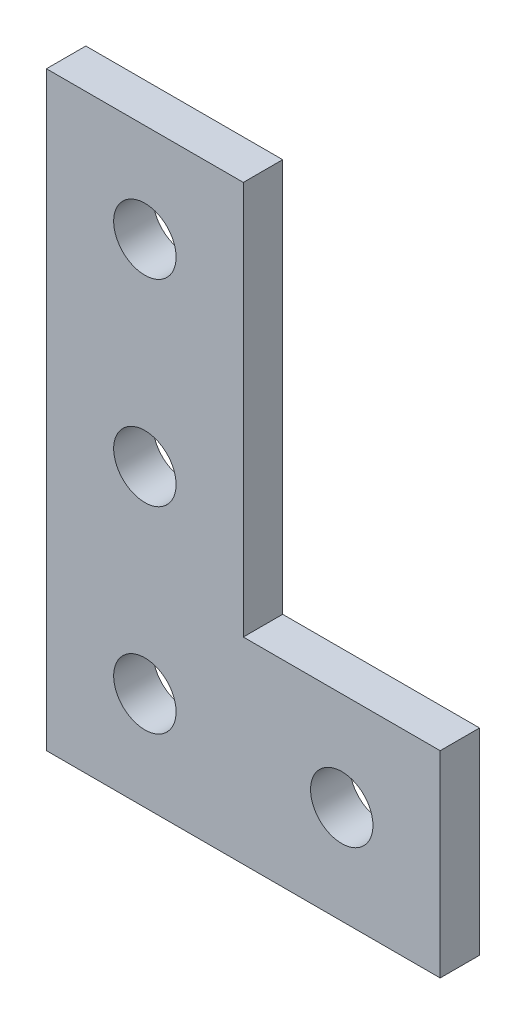
ISO-10303-21;
HEADER;
FILE_DESCRIPTION(('STEP AP214'),'2;1');
FILE_NAME('part.step','',(''),(''),'','','');
FILE_SCHEMA(('AUTOMOTIVE_DESIGN { 1 0 10303 214 1 1 1 1 }'));
ENDSEC;
DATA;
#1=APPLICATION_CONTEXT('core data for automotive mechanical design processes');
#2=APPLICATION_PROTOCOL_DEFINITION('international standard','automotive_design',2000,#1);
#3=PRODUCT_CONTEXT('',#1,'mechanical');
#4=PRODUCT('Part','Part','',(#3));
#5=PRODUCT_RELATED_PRODUCT_CATEGORY('part','',(#4));
#6=PRODUCT_DEFINITION_FORMATION('','',#4);
#7=PRODUCT_DEFINITION_CONTEXT('part definition',#1,'design');
#8=PRODUCT_DEFINITION('design','',#6,#7);
#9=PRODUCT_DEFINITION_SHAPE('','',#8);
#10=(LENGTH_UNIT() NAMED_UNIT(*) SI_UNIT(.MILLI.,.METRE.));
#11=(NAMED_UNIT(*) PLANE_ANGLE_UNIT() SI_UNIT($,.RADIAN.));
#12=(NAMED_UNIT(*) SI_UNIT($,.STERADIAN.) SOLID_ANGLE_UNIT());
#13=UNCERTAINTY_MEASURE_WITH_UNIT(LENGTH_MEASURE(1.E-05),#10,'distance_accuracy_value','');
#14=(GEOMETRIC_REPRESENTATION_CONTEXT(3) GLOBAL_UNCERTAINTY_ASSIGNED_CONTEXT((#13)) GLOBAL_UNIT_ASSIGNED_CONTEXT((#10,
#11,#12)) REPRESENTATION_CONTEXT('',''));
#15=CARTESIAN_POINT('',(0.,0.,0.));
#16=DIRECTION('',(0.,0.,1.));
#17=DIRECTION('',(1.,0.,0.));
#18=AXIS2_PLACEMENT_3D('',#15,#16,#17);
#19=CARTESIAN_POINT('',(-5.,-5.,-1.));
#20=DIRECTION('',(0.,0.,1.));
#21=DIRECTION('',(1.,0.,0.));
#22=AXIS2_PLACEMENT_3D('',#19,#20,#21);
#23=PLANE('',#22);
#24=DIRECTION('',(0.,1.,0.));
#25=VECTOR('',#24,1.);
#26=CARTESIAN_POINT('',(-4.99999999999999,24.9999999999998,-1.));
#27=LINE('',#26,#25);
#28=CARTESIAN_POINT('',(-5.,-5.,-1.));
#29=VERTEX_POINT('',#28);
#30=CARTESIAN_POINT('',(-4.99999999999999,24.9999999999998,-1.));
#31=VERTEX_POINT('',#30);
#32=EDGE_CURVE('E108',#29,#31,#27,.T.);
#33=ORIENTED_EDGE('',*,*,#32,.T.);
#34=DIRECTION('',(1.,0.,0.));
#35=VECTOR('',#34,1.);
#36=CARTESIAN_POINT('',(-4.99999999999999,24.9999999999998,-1.));
#37=LINE('',#36,#35);
#38=CARTESIAN_POINT('',(5.,24.9999999999998,-1.));
#39=VERTEX_POINT('',#38);
#40=EDGE_CURVE('E250',#31,#39,#37,.T.);
#41=ORIENTED_EDGE('',*,*,#40,.T.);
#42=DIRECTION('',(0.,-1.,0.));
#43=VECTOR('',#42,1.);
#44=CARTESIAN_POINT('',(5.00000000000001,24.9999999999998,-1.));
#45=LINE('',#44,#43);
#46=CARTESIAN_POINT('',(5.,5.,-1.));
#47=VERTEX_POINT('',#46);
#48=EDGE_CURVE('E235',#39,#47,#45,.T.);
#49=ORIENTED_EDGE('',*,*,#48,.T.);
#50=DIRECTION('',(1.,0.,0.));
#51=VECTOR('',#50,1.);
#52=CARTESIAN_POINT('',(15.,5.,-1.));
#53=LINE('',#52,#51);
#54=CARTESIAN_POINT('',(15.,5.,-1.));
#55=VERTEX_POINT('',#54);
#56=EDGE_CURVE('E84',#47,#55,#53,.T.);
#57=ORIENTED_EDGE('',*,*,#56,.T.);
#58=DIRECTION('',(0.,1.,0.));
#59=VECTOR('',#58,1.);
#60=CARTESIAN_POINT('',(15.,5.,-1.));
#61=LINE('',#60,#59);
#62=CARTESIAN_POINT('',(15.,-5.,-1.));
#63=VERTEX_POINT('',#62);
#64=EDGE_CURVE('E66',#55,#63,#61,.F.);
#65=ORIENTED_EDGE('',*,*,#64,.T.);
#66=DIRECTION('',(-1.,0.,0.));
#67=VECTOR('',#66,1.);
#68=CARTESIAN_POINT('',(15.,-5.,-1.));
#69=LINE('',#68,#67);
#70=EDGE_CURVE('E71',#63,#29,#69,.T.);
#71=ORIENTED_EDGE('',*,*,#70,.T.);
#72=EDGE_LOOP('',(#33,#41,#49,#57,#65,#71));
#73=FACE_BOUND('',#72,.T.);
#74=CARTESIAN_POINT('',(0.,0.,-1.));
#75=DIRECTION('',(0.,0.,1.));
#76=DIRECTION('',(1.,0.,0.));
#77=AXIS2_PLACEMENT_3D('',#74,#75,#76);
#78=CIRCLE('',#77,1.585);
#79=CARTESIAN_POINT('',(1.585,0.,-1.));
#80=VERTEX_POINT('',#79);
#81=EDGE_CURVE('E80',#80,#80,#78,.T.);
#82=ORIENTED_EDGE('',*,*,#81,.T.);
#83=EDGE_LOOP('',(#82));
#84=FACE_BOUND('',#83,.T.);
#85=CARTESIAN_POINT('',(0.,10.,-1.));
#86=DIRECTION('',(0.,0.,1.));
#87=DIRECTION('',(1.,0.,0.));
#88=AXIS2_PLACEMENT_3D('',#85,#86,#87);
#89=CIRCLE('',#88,1.585);
#90=CARTESIAN_POINT('',(1.58499999999998,10.,-1.));
#91=VERTEX_POINT('',#90);
#92=EDGE_CURVE('E111',#91,#91,#89,.T.);
#93=ORIENTED_EDGE('',*,*,#92,.T.);
#94=EDGE_LOOP('',(#93));
#95=FACE_BOUND('',#94,.T.);
#96=CARTESIAN_POINT('',(10.,0.,-1.));
#97=DIRECTION('',(0.,0.,1.));
#98=DIRECTION('',(1.,0.,0.));
#99=AXIS2_PLACEMENT_3D('',#96,#97,#98);
#100=CIRCLE('',#99,1.585);
#101=CARTESIAN_POINT('',(11.585,0.,-1.));
#102=VERTEX_POINT('',#101);
#103=EDGE_CURVE('E113',#102,#102,#100,.T.);
#104=ORIENTED_EDGE('',*,*,#103,.T.);
#105=EDGE_LOOP('',(#104));
#106=FACE_BOUND('',#105,.T.);
#107=CARTESIAN_POINT('',(0.,20.,-1.));
#108=DIRECTION('',(0.,0.,1.));
#109=DIRECTION('',(1.,0.,0.));
#110=AXIS2_PLACEMENT_3D('',#107,#108,#109);
#111=CIRCLE('',#110,1.585);
#112=CARTESIAN_POINT('',(1.58499999999996,20.,-1.));
#113=VERTEX_POINT('',#112);
#114=EDGE_CURVE('E19',#113,#113,#111,.T.);
#115=ORIENTED_EDGE('',*,*,#114,.T.);
#116=EDGE_LOOP('',(#115));
#117=FACE_BOUND('',#116,.T.);
#118=ADVANCED_FACE('F16',(#73,#84,#95,#106,#117),#23,.F.);
#119=CARTESIAN_POINT('',(0.,20.,1.));
#120=DIRECTION('',(0.,0.,1.));
#121=DIRECTION('',(1.,0.,0.));
#122=AXIS2_PLACEMENT_3D('',#119,#120,#121);
#123=CYLINDRICAL_SURFACE('',#122,1.585);
#124=CARTESIAN_POINT('',(0.,20.,1.));
#125=DIRECTION('',(0.,0.,1.));
#126=DIRECTION('',(1.,0.,0.));
#127=AXIS2_PLACEMENT_3D('',#124,#125,#126);
#128=CIRCLE('',#127,1.585);
#129=CARTESIAN_POINT('',(1.58499999999996,20.,1.));
#130=VERTEX_POINT('',#129);
#131=EDGE_CURVE('E105',#130,#130,#128,.F.);
#132=ORIENTED_EDGE('',*,*,#131,.F.);
#133=EDGE_LOOP('',(#132));
#134=FACE_BOUND('',#133,.T.);
#135=ORIENTED_EDGE('',*,*,#114,.F.);
#136=EDGE_LOOP('',(#135));
#137=FACE_BOUND('',#136,.T.);
#138=ADVANCED_FACE('F121',(#134,#137),#123,.F.);
#139=CARTESIAN_POINT('',(10.,0.,1.));
#140=DIRECTION('',(0.,0.,1.));
#141=DIRECTION('',(1.,0.,0.));
#142=AXIS2_PLACEMENT_3D('',#139,#140,#141);
#143=CYLINDRICAL_SURFACE('',#142,1.585);
#144=CARTESIAN_POINT('',(10.,0.,1.));
#145=DIRECTION('',(0.,0.,1.));
#146=DIRECTION('',(1.,0.,0.));
#147=AXIS2_PLACEMENT_3D('',#144,#145,#146);
#148=CIRCLE('',#147,1.585);
#149=CARTESIAN_POINT('',(11.585,0.,1.));
#150=VERTEX_POINT('',#149);
#151=EDGE_CURVE('E102',#150,#150,#148,.F.);
#152=ORIENTED_EDGE('',*,*,#151,.F.);
#153=EDGE_LOOP('',(#152));
#154=FACE_BOUND('',#153,.T.);
#155=ORIENTED_EDGE('',*,*,#103,.F.);
#156=EDGE_LOOP('',(#155));
#157=FACE_BOUND('',#156,.T.);
#158=ADVANCED_FACE('F123',(#154,#157),#143,.F.);
#159=CARTESIAN_POINT('',(0.,10.,1.));
#160=DIRECTION('',(0.,0.,1.));
#161=DIRECTION('',(1.,0.,0.));
#162=AXIS2_PLACEMENT_3D('',#159,#160,#161);
#163=CYLINDRICAL_SURFACE('',#162,1.585);
#164=CARTESIAN_POINT('',(0.,10.,1.));
#165=DIRECTION('',(0.,0.,1.));
#166=DIRECTION('',(1.,0.,0.));
#167=AXIS2_PLACEMENT_3D('',#164,#165,#166);
#168=CIRCLE('',#167,1.585);
#169=CARTESIAN_POINT('',(1.58499999999998,10.,1.));
#170=VERTEX_POINT('',#169);
#171=EDGE_CURVE('E99',#170,#170,#168,.F.);
#172=ORIENTED_EDGE('',*,*,#171,.F.);
#173=EDGE_LOOP('',(#172));
#174=FACE_BOUND('',#173,.T.);
#175=ORIENTED_EDGE('',*,*,#92,.F.);
#176=EDGE_LOOP('',(#175));
#177=FACE_BOUND('',#176,.T.);
#178=ADVANCED_FACE('F130',(#174,#177),#163,.F.);
#179=CARTESIAN_POINT('',(0.,0.,1.));
#180=DIRECTION('',(0.,0.,1.));
#181=DIRECTION('',(1.,0.,0.));
#182=AXIS2_PLACEMENT_3D('',#179,#180,#181);
#183=CYLINDRICAL_SURFACE('',#182,1.585);
#184=CARTESIAN_POINT('',(0.,0.,1.));
#185=DIRECTION('',(0.,0.,1.));
#186=DIRECTION('',(1.,0.,0.));
#187=AXIS2_PLACEMENT_3D('',#184,#185,#186);
#188=CIRCLE('',#187,1.585);
#189=CARTESIAN_POINT('',(1.585,0.,1.));
#190=VERTEX_POINT('',#189);
#191=EDGE_CURVE('E95',#190,#190,#188,.F.);
#192=ORIENTED_EDGE('',*,*,#191,.F.);
#193=EDGE_LOOP('',(#192));
#194=FACE_BOUND('',#193,.T.);
#195=ORIENTED_EDGE('',*,*,#81,.F.);
#196=EDGE_LOOP('',(#195));
#197=FACE_BOUND('',#196,.T.);
#198=ADVANCED_FACE('F162',(#194,#197),#183,.F.);
#199=CARTESIAN_POINT('',(15.,-5.,1.));
#200=DIRECTION('',(0.,1.,0.));
#201=DIRECTION('',(-1.,0.,0.));
#202=AXIS2_PLACEMENT_3D('',#199,#200,#201);
#203=PLANE('',#202);
#204=DIRECTION('',(0.,0.,1.));
#205=VECTOR('',#204,1.);
#206=CARTESIAN_POINT('',(15.,-5.,1.));
#207=LINE('',#206,#205);
#208=CARTESIAN_POINT('',(15.,-5.,1.));
#209=VERTEX_POINT('',#208);
#210=EDGE_CURVE('E73',#63,#209,#207,.T.);
#211=ORIENTED_EDGE('',*,*,#210,.T.);
#212=DIRECTION('',(1.,0.,0.));
#213=VECTOR('',#212,1.);
#214=CARTESIAN_POINT('',(-5.,-5.,1.));
#215=LINE('',#214,#213);
#216=CARTESIAN_POINT('',(-5.,-5.,1.));
#217=VERTEX_POINT('',#216);
#218=EDGE_CURVE('E98',#217,#209,#215,.T.);
#219=ORIENTED_EDGE('',*,*,#218,.F.);
#220=DIRECTION('',(0.,0.,1.));
#221=VECTOR('',#220,1.);
#222=CARTESIAN_POINT('',(-5.,-5.,1.));
#223=LINE('',#222,#221);
#224=EDGE_CURVE('E76',#217,#29,#223,.F.);
#225=ORIENTED_EDGE('',*,*,#224,.T.);
#226=ORIENTED_EDGE('',*,*,#70,.F.);
#227=EDGE_LOOP('',(#211,#219,#225,#226));
#228=FACE_BOUND('',#227,.T.);
#229=ADVANCED_FACE('F72',(#228),#203,.F.);
#230=CARTESIAN_POINT('',(15.,5.,1.));
#231=DIRECTION('',(-1.,0.,0.));
#232=DIRECTION('',(0.,0.,1.));
#233=AXIS2_PLACEMENT_3D('',#230,#231,#232);
#234=PLANE('',#233);
#235=DIRECTION('',(0.,0.,1.));
#236=VECTOR('',#235,1.);
#237=CARTESIAN_POINT('',(15.,5.,1.));
#238=LINE('',#237,#236);
#239=CARTESIAN_POINT('',(15.,5.,1.));
#240=VERTEX_POINT('',#239);
#241=EDGE_CURVE('E86',#55,#240,#238,.T.);
#242=ORIENTED_EDGE('',*,*,#241,.T.);
#243=DIRECTION('',(0.,1.,0.));
#244=VECTOR('',#243,1.);
#245=CARTESIAN_POINT('',(15.,-5.,1.));
#246=LINE('',#245,#244);
#247=EDGE_CURVE('E90',#209,#240,#246,.T.);
#248=ORIENTED_EDGE('',*,*,#247,.F.);
#249=ORIENTED_EDGE('',*,*,#210,.F.);
#250=ORIENTED_EDGE('',*,*,#64,.F.);
#251=EDGE_LOOP('',(#242,#248,#249,#250));
#252=FACE_BOUND('',#251,.T.);
#253=ADVANCED_FACE('F88',(#252),#234,.F.);
#254=CARTESIAN_POINT('',(15.,5.,1.));
#255=DIRECTION('',(0.,-1.,0.));
#256=DIRECTION('',(1.,0.,0.));
#257=AXIS2_PLACEMENT_3D('',#254,#255,#256);
#258=PLANE('',#257);
#259=DIRECTION('',(0.,0.,1.));
#260=VECTOR('',#259,1.);
#261=CARTESIAN_POINT('',(5.,5.,1.));
#262=LINE('',#261,#260);
#263=CARTESIAN_POINT('',(5.,5.,1.));
#264=VERTEX_POINT('',#263);
#265=EDGE_CURVE('E231',#47,#264,#262,.T.);
#266=ORIENTED_EDGE('',*,*,#265,.T.);
#267=DIRECTION('',(1.,0.,0.));
#268=VECTOR('',#267,1.);
#269=CARTESIAN_POINT('',(-5.,5.,1.));
#270=LINE('',#269,#268);
#271=EDGE_CURVE('E234',#240,#264,#270,.F.);
#272=ORIENTED_EDGE('',*,*,#271,.F.);
#273=ORIENTED_EDGE('',*,*,#241,.F.);
#274=ORIENTED_EDGE('',*,*,#56,.F.);
#275=EDGE_LOOP('',(#266,#272,#273,#274));
#276=FACE_BOUND('',#275,.T.);
#277=ADVANCED_FACE('F153',(#276),#258,.F.);
#278=CARTESIAN_POINT('',(5.00000000000001,24.9999999999998,1.));
#279=DIRECTION('',(-1.,0.,0.));
#280=DIRECTION('',(0.,-1.,0.));
#281=AXIS2_PLACEMENT_3D('',#278,#279,#280);
#282=PLANE('',#281);
#283=DIRECTION('',(0.,0.,-1.));
#284=VECTOR('',#283,1.);
#285=CARTESIAN_POINT('',(5.00000000000001,24.9999999999998,1.));
#286=LINE('',#285,#284);
#287=CARTESIAN_POINT('',(5.,24.9999999999998,1.));
#288=VERTEX_POINT('',#287);
#289=EDGE_CURVE('E240',#39,#288,#286,.F.);
#290=ORIENTED_EDGE('',*,*,#289,.T.);
#291=DIRECTION('',(0.,1.,0.));
#292=VECTOR('',#291,1.);
#293=CARTESIAN_POINT('',(5.,-5.,1.));
#294=LINE('',#293,#292);
#295=EDGE_CURVE('E238',#264,#288,#294,.T.);
#296=ORIENTED_EDGE('',*,*,#295,.F.);
#297=ORIENTED_EDGE('',*,*,#265,.F.);
#298=ORIENTED_EDGE('',*,*,#48,.F.);
#299=EDGE_LOOP('',(#290,#296,#297,#298));
#300=FACE_BOUND('',#299,.T.);
#301=ADVANCED_FACE('F150',(#300),#282,.F.);
#302=CARTESIAN_POINT('',(-4.99999999999999,24.9999999999998,1.));
#303=DIRECTION('',(0.,-1.,0.));
#304=DIRECTION('',(0.,0.,-1.));
#305=AXIS2_PLACEMENT_3D('',#302,#303,#304);
#306=PLANE('',#305);
#307=DIRECTION('',(0.,0.,1.));
#308=VECTOR('',#307,1.);
#309=CARTESIAN_POINT('',(-4.99999999999999,24.9999999999998,1.));
#310=LINE('',#309,#308);
#311=CARTESIAN_POINT('',(-4.99999999999999,24.9999999999998,1.));
#312=VERTEX_POINT('',#311);
#313=EDGE_CURVE('E34',#31,#312,#310,.T.);
#314=ORIENTED_EDGE('',*,*,#313,.T.);
#315=DIRECTION('',(1.,0.,0.));
#316=VECTOR('',#315,1.);
#317=CARTESIAN_POINT('',(-5.,24.9999999999998,1.));
#318=LINE('',#317,#316);
#319=EDGE_CURVE('E25',#288,#312,#318,.F.);
#320=ORIENTED_EDGE('',*,*,#319,.F.);
#321=ORIENTED_EDGE('',*,*,#289,.F.);
#322=ORIENTED_EDGE('',*,*,#40,.F.);
#323=EDGE_LOOP('',(#314,#320,#321,#322));
#324=FACE_BOUND('',#323,.T.);
#325=ADVANCED_FACE('F142',(#324),#306,.F.);
#326=CARTESIAN_POINT('',(-4.99999999999999,24.9999999999998,1.));
#327=DIRECTION('',(1.,0.,0.));
#328=DIRECTION('',(0.,1.,0.));
#329=AXIS2_PLACEMENT_3D('',#326,#327,#328);
#330=PLANE('',#329);
#331=ORIENTED_EDGE('',*,*,#224,.F.);
#332=DIRECTION('',(0.,1.,0.));
#333=VECTOR('',#332,1.);
#334=CARTESIAN_POINT('',(-4.99999999999999,-5.,1.));
#335=LINE('',#334,#333);
#336=EDGE_CURVE('E10',#312,#217,#335,.F.);
#337=ORIENTED_EDGE('',*,*,#336,.F.);
#338=ORIENTED_EDGE('',*,*,#313,.F.);
#339=ORIENTED_EDGE('',*,*,#32,.F.);
#340=EDGE_LOOP('',(#331,#337,#338,#339));
#341=FACE_BOUND('',#340,.T.);
#342=ADVANCED_FACE('F136',(#341),#330,.F.);
#343=CARTESIAN_POINT('',(-5.,-5.,1.));
#344=DIRECTION('',(0.,0.,1.));
#345=DIRECTION('',(1.,0.,0.));
#346=AXIS2_PLACEMENT_3D('',#343,#344,#345);
#347=PLANE('',#346);
#348=ORIENTED_EDGE('',*,*,#319,.T.);
#349=ORIENTED_EDGE('',*,*,#336,.T.);
#350=ORIENTED_EDGE('',*,*,#218,.T.);
#351=ORIENTED_EDGE('',*,*,#247,.T.);
#352=ORIENTED_EDGE('',*,*,#271,.T.);
#353=ORIENTED_EDGE('',*,*,#295,.T.);
#354=EDGE_LOOP('',(#348,#349,#350,#351,#352,#353));
#355=FACE_BOUND('',#354,.T.);
#356=ORIENTED_EDGE('',*,*,#191,.T.);
#357=EDGE_LOOP('',(#356));
#358=FACE_BOUND('',#357,.T.);
#359=ORIENTED_EDGE('',*,*,#171,.T.);
#360=EDGE_LOOP('',(#359));
#361=FACE_BOUND('',#360,.T.);
#362=ORIENTED_EDGE('',*,*,#151,.T.);
#363=EDGE_LOOP('',(#362));
#364=FACE_BOUND('',#363,.T.);
#365=ORIENTED_EDGE('',*,*,#131,.T.);
#366=EDGE_LOOP('',(#365));
#367=FACE_BOUND('',#366,.T.);
#368=ADVANCED_FACE('F134',(#355,#358,#361,#364,#367),#347,.T.);
#369=CLOSED_SHELL('',(#118,#138,#158,#178,#198,#229,#253,#277,#301,#325,#342,#368));
#370=MANIFOLD_SOLID_BREP('B1',#369);
#371=ADVANCED_BREP_SHAPE_REPRESENTATION('',(#18,#370),#14);
#372=SHAPE_DEFINITION_REPRESENTATION(#9,#371);
ENDSEC;
END-ISO-10303-21;
